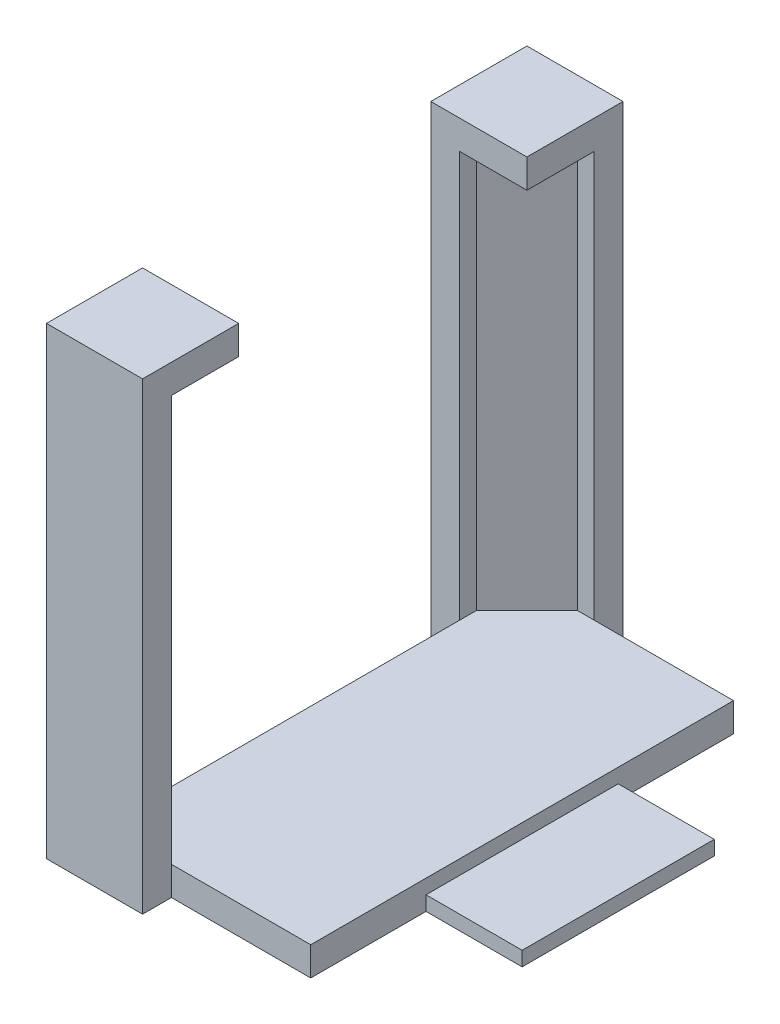
ISO-10303-21;
HEADER;
FILE_DESCRIPTION(('STEP AP214'),'2;1');
FILE_NAME('part.step','',(''),(''),'','','');
FILE_SCHEMA(('AUTOMOTIVE_DESIGN { 1 0 10303 214 1 1 1 1 }'));
ENDSEC;
DATA;
#1=APPLICATION_CONTEXT('core data for automotive mechanical design processes');
#2=APPLICATION_PROTOCOL_DEFINITION('international standard','automotive_design',2000,#1);
#3=PRODUCT_CONTEXT('',#1,'mechanical');
#4=PRODUCT('Part','Part','',(#3));
#5=PRODUCT_RELATED_PRODUCT_CATEGORY('part','',(#4));
#6=PRODUCT_DEFINITION_FORMATION('','',#4);
#7=PRODUCT_DEFINITION_CONTEXT('part definition',#1,'design');
#8=PRODUCT_DEFINITION('design','',#6,#7);
#9=PRODUCT_DEFINITION_SHAPE('','',#8);
#10=(LENGTH_UNIT() NAMED_UNIT(*) SI_UNIT(.MILLI.,.METRE.));
#11=(NAMED_UNIT(*) PLANE_ANGLE_UNIT() SI_UNIT($,.RADIAN.));
#12=(NAMED_UNIT(*) SI_UNIT($,.STERADIAN.) SOLID_ANGLE_UNIT());
#13=UNCERTAINTY_MEASURE_WITH_UNIT(LENGTH_MEASURE(1.E-05),#10,'distance_accuracy_value','');
#14=(GEOMETRIC_REPRESENTATION_CONTEXT(3) GLOBAL_UNCERTAINTY_ASSIGNED_CONTEXT((#13)) GLOBAL_UNIT_ASSIGNED_CONTEXT((#10,
#11,#12)) REPRESENTATION_CONTEXT('',''));
#15=CARTESIAN_POINT('',(0.,0.,0.));
#16=DIRECTION('',(0.,0.,1.));
#17=DIRECTION('',(1.,0.,0.));
#18=AXIS2_PLACEMENT_3D('',#15,#16,#17);
#19=CARTESIAN_POINT('',(-21.5,3.,0.));
#20=DIRECTION('',(-1.,0.,0.));
#21=DIRECTION('',(0.,0.,1.));
#22=AXIS2_PLACEMENT_3D('',#19,#20,#21);
#23=PLANE('',#22);
#24=DIRECTION('',(0.,-1.,0.));
#25=VECTOR('',#24,1.);
#26=CARTESIAN_POINT('',(-21.5,45.25,-37.));
#27=LINE('',#26,#25);
#28=CARTESIAN_POINT('',(-21.5,3.,-37.));
#29=VERTEX_POINT('',#28);
#30=CARTESIAN_POINT('',(-21.5,0.,-37.));
#31=VERTEX_POINT('',#30);
#32=EDGE_CURVE('E278',#29,#31,#27,.T.);
#33=ORIENTED_EDGE('',*,*,#32,.T.);
#34=DIRECTION('',(0.,0.,-1.));
#35=VECTOR('',#34,1.);
#36=CARTESIAN_POINT('',(-21.5,0.,0.));
#37=LINE('',#36,#35);
#38=CARTESIAN_POINT('',(-21.5,0.,-7.));
#39=VERTEX_POINT('',#38);
#40=EDGE_CURVE('E349',#39,#31,#37,.T.);
#41=ORIENTED_EDGE('',*,*,#40,.F.);
#42=DIRECTION('',(0.,-1.,0.));
#43=VECTOR('',#42,1.);
#44=CARTESIAN_POINT('',(-21.5,45.25,-7.));
#45=LINE('',#44,#43);
#46=CARTESIAN_POINT('',(-21.5,3.,-7.));
#47=VERTEX_POINT('',#46);
#48=EDGE_CURVE('E315',#47,#39,#45,.T.);
#49=ORIENTED_EDGE('',*,*,#48,.F.);
#50=DIRECTION('',(0.,0.,-1.));
#51=VECTOR('',#50,1.);
#52=CARTESIAN_POINT('',(-21.5,3.,0.));
#53=LINE('',#52,#51);
#54=EDGE_CURVE('E353',#47,#29,#53,.T.);
#55=ORIENTED_EDGE('',*,*,#54,.T.);
#56=EDGE_LOOP('',(#33,#41,#49,#55));
#57=FACE_BOUND('',#56,.T.);
#58=ADVANCED_FACE('F41',(#57),#23,.T.);
#59=CARTESIAN_POINT('',(0.,3.,0.));
#60=DIRECTION('',(0.,0.,1.));
#61=DIRECTION('',(1.,0.,0.));
#62=AXIS2_PLACEMENT_3D('',#59,#60,#61);
#63=PLANE('',#62);
#64=DIRECTION('',(-1.,0.,0.));
#65=VECTOR('',#64,1.);
#66=CARTESIAN_POINT('',(0.,3.,0.));
#67=LINE('',#66,#65);
#68=CARTESIAN_POINT('',(0.,3.,0.));
#69=VERTEX_POINT('',#68);
#70=CARTESIAN_POINT('',(-14.5,3.,0.));
#71=VERTEX_POINT('',#70);
#72=EDGE_CURVE('E352',#69,#71,#67,.T.);
#73=ORIENTED_EDGE('',*,*,#72,.T.);
#74=DIRECTION('',(0.,-1.,0.));
#75=VECTOR('',#74,1.);
#76=CARTESIAN_POINT('',(-14.5,45.25,0.));
#77=LINE('',#76,#75);
#78=CARTESIAN_POINT('',(-14.5,0.,0.));
#79=VERTEX_POINT('',#78);
#80=EDGE_CURVE('E296',#71,#79,#77,.T.);
#81=ORIENTED_EDGE('',*,*,#80,.T.);
#82=DIRECTION('',(-1.,0.,0.));
#83=VECTOR('',#82,1.);
#84=CARTESIAN_POINT('',(0.,0.,0.));
#85=LINE('',#84,#83);
#86=CARTESIAN_POINT('',(0.,0.,0.));
#87=VERTEX_POINT('',#86);
#88=EDGE_CURVE('E364',#87,#79,#85,.T.);
#89=ORIENTED_EDGE('',*,*,#88,.F.);
#90=DIRECTION('',(0.,-1.,0.));
#91=VECTOR('',#90,1.);
#92=CARTESIAN_POINT('',(0.,3.,0.));
#93=LINE('',#92,#91);
#94=EDGE_CURVE('E375',#69,#87,#93,.T.);
#95=ORIENTED_EDGE('',*,*,#94,.F.);
#96=EDGE_LOOP('',(#73,#81,#89,#95));
#97=FACE_BOUND('',#96,.T.);
#98=ADVANCED_FACE('F467',(#97),#63,.T.);
#99=CARTESIAN_POINT('',(0.,3.,0.));
#100=DIRECTION('',(-1.,0.,0.));
#101=DIRECTION('',(0.,0.,1.));
#102=AXIS2_PLACEMENT_3D('',#99,#100,#101);
#103=PLANE('',#102);
#104=DIRECTION('',(0.,-1.,0.));
#105=VECTOR('',#104,1.);
#106=CARTESIAN_POINT('',(0.,1.5,-12.));
#107=LINE('',#106,#105);
#108=CARTESIAN_POINT('',(0.,1.5,-12.));
#109=VERTEX_POINT('',#108);
#110=CARTESIAN_POINT('',(0.,0.,-12.));
#111=VERTEX_POINT('',#110);
#112=EDGE_CURVE('E341',#109,#111,#107,.T.);
#113=ORIENTED_EDGE('',*,*,#112,.F.);
#114=DIRECTION('',(0.,0.,-1.));
#115=VECTOR('',#114,1.);
#116=CARTESIAN_POINT('',(0.,1.5,0.));
#117=LINE('',#116,#115);
#118=CARTESIAN_POINT('',(0.,1.5,-32.));
#119=VERTEX_POINT('',#118);
#120=EDGE_CURVE('E328',#109,#119,#117,.T.);
#121=ORIENTED_EDGE('',*,*,#120,.T.);
#122=DIRECTION('',(0.,-1.,0.));
#123=VECTOR('',#122,1.);
#124=CARTESIAN_POINT('',(0.,1.5,-32.));
#125=LINE('',#124,#123);
#126=CARTESIAN_POINT('',(0.,0.,-32.));
#127=VERTEX_POINT('',#126);
#128=EDGE_CURVE('E343',#119,#127,#125,.T.);
#129=ORIENTED_EDGE('',*,*,#128,.T.);
#130=DIRECTION('',(0.,0.,-1.));
#131=VECTOR('',#130,1.);
#132=CARTESIAN_POINT('',(0.,0.,0.));
#133=LINE('',#132,#131);
#134=CARTESIAN_POINT('',(0.,0.,-44.));
#135=VERTEX_POINT('',#134);
#136=EDGE_CURVE('E367',#127,#135,#133,.T.);
#137=ORIENTED_EDGE('',*,*,#136,.T.);
#138=DIRECTION('',(0.,-1.,0.));
#139=VECTOR('',#138,1.);
#140=CARTESIAN_POINT('',(0.,3.,-44.));
#141=LINE('',#140,#139);
#142=CARTESIAN_POINT('',(0.,3.,-44.));
#143=VERTEX_POINT('',#142);
#144=EDGE_CURVE('E361',#143,#135,#141,.T.);
#145=ORIENTED_EDGE('',*,*,#144,.F.);
#146=DIRECTION('',(0.,0.,-1.));
#147=VECTOR('',#146,1.);
#148=CARTESIAN_POINT('',(0.,3.,0.));
#149=LINE('',#148,#147);
#150=EDGE_CURVE('E356',#69,#143,#149,.T.);
#151=ORIENTED_EDGE('',*,*,#150,.F.);
#152=ORIENTED_EDGE('',*,*,#94,.T.);
#153=EDGE_CURVE('E368',#87,#111,#133,.T.);
#154=ORIENTED_EDGE('',*,*,#153,.T.);
#155=EDGE_LOOP('',(#113,#121,#129,#137,#145,#151,#152,#154));
#156=FACE_BOUND('',#155,.T.);
#157=ADVANCED_FACE('F472',(#156),#103,.F.);
#158=CARTESIAN_POINT('',(0.,3.,-44.));
#159=DIRECTION('',(0.,0.,1.));
#160=DIRECTION('',(1.,0.,0.));
#161=AXIS2_PLACEMENT_3D('',#158,#159,#160);
#162=PLANE('',#161);
#163=DIRECTION('',(-1.,0.,0.));
#164=VECTOR('',#163,1.);
#165=CARTESIAN_POINT('',(0.,0.,-44.));
#166=LINE('',#165,#164);
#167=CARTESIAN_POINT('',(-14.5,0.,-44.));
#168=VERTEX_POINT('',#167);
#169=EDGE_CURVE('E371',#135,#168,#166,.T.);
#170=ORIENTED_EDGE('',*,*,#169,.T.);
#171=DIRECTION('',(0.,-1.,0.));
#172=VECTOR('',#171,1.);
#173=CARTESIAN_POINT('',(-14.5,45.25,-44.));
#174=LINE('',#173,#172);
#175=CARTESIAN_POINT('',(-14.5,3.,-44.));
#176=VERTEX_POINT('',#175);
#177=EDGE_CURVE('E265',#176,#168,#174,.T.);
#178=ORIENTED_EDGE('',*,*,#177,.F.);
#179=DIRECTION('',(-1.,0.,0.));
#180=VECTOR('',#179,1.);
#181=CARTESIAN_POINT('',(0.,3.,-44.));
#182=LINE('',#181,#180);
#183=EDGE_CURVE('E358',#143,#176,#182,.T.);
#184=ORIENTED_EDGE('',*,*,#183,.F.);
#185=ORIENTED_EDGE('',*,*,#144,.T.);
#186=EDGE_LOOP('',(#170,#178,#184,#185));
#187=FACE_BOUND('',#186,.T.);
#188=ADVANCED_FACE('F546',(#187),#162,.F.);
#189=CARTESIAN_POINT('',(0.,3.,0.));
#190=DIRECTION('',(0.,1.,0.));
#191=DIRECTION('',(0.,0.,1.));
#192=AXIS2_PLACEMENT_3D('',#189,#190,#191);
#193=PLANE('',#192);
#194=DIRECTION('',(1.,0.,0.));
#195=VECTOR('',#194,1.);
#196=CARTESIAN_POINT('',(0.,3.,-44.));
#197=LINE('',#196,#195);
#198=CARTESIAN_POINT('',(-16.25,3.,-44.));
#199=VERTEX_POINT('',#198);
#200=EDGE_CURVE('E286',#199,#176,#197,.T.);
#201=ORIENTED_EDGE('',*,*,#200,.F.);
#202=DIRECTION('',(-0.707106781186552,0.,0.707106781186543));
#203=VECTOR('',#202,1.);
#204=CARTESIAN_POINT('',(-30.1249999999999,3.,-30.1250000000002));
#205=LINE('',#204,#203);
#206=CARTESIAN_POINT('',(-21.5,3.,-38.75));
#207=VERTEX_POINT('',#206);
#208=EDGE_CURVE('E382',#199,#207,#205,.T.);
#209=ORIENTED_EDGE('',*,*,#208,.T.);
#210=DIRECTION('',(0.,0.,1.));
#211=VECTOR('',#210,1.);
#212=CARTESIAN_POINT('',(-21.5,3.,0.));
#213=LINE('',#212,#211);
#214=EDGE_CURVE('E288',#207,#29,#213,.T.);
#215=ORIENTED_EDGE('',*,*,#214,.T.);
#216=ORIENTED_EDGE('',*,*,#54,.F.);
#217=CARTESIAN_POINT('',(-21.5,3.,-5.25000000000004));
#218=VERTEX_POINT('',#217);
#219=EDGE_CURVE('E350',#218,#47,#53,.T.);
#220=ORIENTED_EDGE('',*,*,#219,.F.);
#221=DIRECTION('',(-0.707106781186544,0.,-0.707106781186551));
#222=VECTOR('',#221,1.);
#223=CARTESIAN_POINT('',(-8.1250000000001,3.,8.12500000000001));
#224=LINE('',#223,#222);
#225=CARTESIAN_POINT('',(-16.25,3.,0.));
#226=VERTEX_POINT('',#225);
#227=EDGE_CURVE('E380',#218,#226,#224,.F.);
#228=ORIENTED_EDGE('',*,*,#227,.T.);
#229=DIRECTION('',(1.,0.,0.));
#230=VECTOR('',#229,1.);
#231=CARTESIAN_POINT('',(0.,3.,0.));
#232=LINE('',#231,#230);
#233=EDGE_CURVE('E319',#226,#71,#232,.T.);
#234=ORIENTED_EDGE('',*,*,#233,.T.);
#235=ORIENTED_EDGE('',*,*,#72,.F.);
#236=ORIENTED_EDGE('',*,*,#150,.T.);
#237=ORIENTED_EDGE('',*,*,#183,.T.);
#238=EDGE_LOOP('',(#201,#209,#215,#216,#220,#228,#234,#235,#236,#237));
#239=FACE_BOUND('',#238,.T.);
#240=ADVANCED_FACE('F399',(#239),#193,.T.);
#241=CARTESIAN_POINT('',(0.,0.,0.));
#242=DIRECTION('',(0.,1.,0.));
#243=DIRECTION('',(0.,0.,1.));
#244=AXIS2_PLACEMENT_3D('',#241,#242,#243);
#245=PLANE('',#244);
#246=DIRECTION('',(-1.,0.,0.));
#247=VECTOR('',#246,1.);
#248=CARTESIAN_POINT('',(0.,0.,-7.));
#249=LINE('',#248,#247);
#250=CARTESIAN_POINT('',(-24.5,0.,-7.));
#251=VERTEX_POINT('',#250);
#252=EDGE_CURVE('E290',#39,#251,#249,.T.);
#253=ORIENTED_EDGE('',*,*,#252,.F.);
#254=ORIENTED_EDGE('',*,*,#40,.T.);
#255=DIRECTION('',(-1.,0.,0.));
#256=VECTOR('',#255,1.);
#257=CARTESIAN_POINT('',(0.,0.,-37.));
#258=LINE('',#257,#256);
#259=CARTESIAN_POINT('',(-24.5,0.,-37.));
#260=VERTEX_POINT('',#259);
#261=EDGE_CURVE('E263',#31,#260,#258,.T.);
#262=ORIENTED_EDGE('',*,*,#261,.T.);
#263=DIRECTION('',(0.,0.,-1.));
#264=VECTOR('',#263,1.);
#265=CARTESIAN_POINT('',(-24.5,0.,0.));
#266=LINE('',#265,#264);
#267=CARTESIAN_POINT('',(-24.5,0.,-47.));
#268=VERTEX_POINT('',#267);
#269=EDGE_CURVE('E271',#260,#268,#266,.T.);
#270=ORIENTED_EDGE('',*,*,#269,.T.);
#271=DIRECTION('',(1.,0.,0.));
#272=VECTOR('',#271,1.);
#273=CARTESIAN_POINT('',(0.,0.,-47.));
#274=LINE('',#273,#272);
#275=CARTESIAN_POINT('',(-14.5,0.,-47.));
#276=VERTEX_POINT('',#275);
#277=EDGE_CURVE('E268',#268,#276,#274,.T.);
#278=ORIENTED_EDGE('',*,*,#277,.T.);
#279=DIRECTION('',(0.,0.,1.));
#280=VECTOR('',#279,1.);
#281=CARTESIAN_POINT('',(-14.5,0.,0.));
#282=LINE('',#281,#280);
#283=EDGE_CURVE('E260',#276,#168,#282,.T.);
#284=ORIENTED_EDGE('',*,*,#283,.T.);
#285=ORIENTED_EDGE('',*,*,#169,.F.);
#286=ORIENTED_EDGE('',*,*,#136,.F.);
#287=DIRECTION('',(-1.,0.,0.));
#288=VECTOR('',#287,1.);
#289=CARTESIAN_POINT('',(0.,0.,-32.));
#290=LINE('',#289,#288);
#291=CARTESIAN_POINT('',(10.,0.,-32.));
#292=VERTEX_POINT('',#291);
#293=EDGE_CURVE('E336',#292,#127,#290,.T.);
#294=ORIENTED_EDGE('',*,*,#293,.F.);
#295=DIRECTION('',(0.,0.,-1.));
#296=VECTOR('',#295,1.);
#297=CARTESIAN_POINT('',(10.,0.,0.));
#298=LINE('',#297,#296);
#299=CARTESIAN_POINT('',(10.,0.,-12.));
#300=VERTEX_POINT('',#299);
#301=EDGE_CURVE('E321',#300,#292,#298,.T.);
#302=ORIENTED_EDGE('',*,*,#301,.F.);
#303=DIRECTION('',(1.,0.,0.));
#304=VECTOR('',#303,1.);
#305=CARTESIAN_POINT('',(0.,0.,-12.));
#306=LINE('',#305,#304);
#307=EDGE_CURVE('E326',#111,#300,#306,.T.);
#308=ORIENTED_EDGE('',*,*,#307,.F.);
#309=ORIENTED_EDGE('',*,*,#153,.F.);
#310=ORIENTED_EDGE('',*,*,#88,.T.);
#311=DIRECTION('',(0.,0.,-1.));
#312=VECTOR('',#311,1.);
#313=CARTESIAN_POINT('',(-14.5,0.,0.));
#314=LINE('',#313,#312);
#315=CARTESIAN_POINT('',(-14.5,0.,3.));
#316=VERTEX_POINT('',#315);
#317=EDGE_CURVE('E294',#316,#79,#314,.T.);
#318=ORIENTED_EDGE('',*,*,#317,.F.);
#319=DIRECTION('',(1.,0.,0.));
#320=VECTOR('',#319,1.);
#321=CARTESIAN_POINT('',(0.,0.,2.99999999999999));
#322=LINE('',#321,#320);
#323=CARTESIAN_POINT('',(-24.5,0.,3.00000000000001));
#324=VERTEX_POINT('',#323);
#325=EDGE_CURVE('E300',#324,#316,#322,.T.);
#326=ORIENTED_EDGE('',*,*,#325,.F.);
#327=DIRECTION('',(0.,0.,1.));
#328=VECTOR('',#327,1.);
#329=CARTESIAN_POINT('',(-24.5,0.,0.));
#330=LINE('',#329,#328);
#331=EDGE_CURVE('E298',#251,#324,#330,.T.);
#332=ORIENTED_EDGE('',*,*,#331,.F.);
#333=EDGE_LOOP('',(#253,#254,#262,#270,#278,#284,#285,#286,#294,#302,#308,#309,#310,#318,#326,#332));
#334=FACE_BOUND('',#333,.T.);
#335=ADVANCED_FACE('F424',(#334),#245,.F.);
#336=CARTESIAN_POINT('',(10.,1.5,0.));
#337=DIRECTION('',(-1.,0.,0.));
#338=DIRECTION('',(0.,0.,1.));
#339=AXIS2_PLACEMENT_3D('',#336,#337,#338);
#340=PLANE('',#339);
#341=ORIENTED_EDGE('',*,*,#301,.T.);
#342=DIRECTION('',(0.,-1.,0.));
#343=VECTOR('',#342,1.);
#344=CARTESIAN_POINT('',(10.,1.5,-32.));
#345=LINE('',#344,#343);
#346=CARTESIAN_POINT('',(10.,1.5,-32.));
#347=VERTEX_POINT('',#346);
#348=EDGE_CURVE('E346',#347,#292,#345,.T.);
#349=ORIENTED_EDGE('',*,*,#348,.F.);
#350=DIRECTION('',(0.,0.,-1.));
#351=VECTOR('',#350,1.);
#352=CARTESIAN_POINT('',(10.,1.5,0.));
#353=LINE('',#352,#351);
#354=CARTESIAN_POINT('',(10.,1.5,-12.));
#355=VERTEX_POINT('',#354);
#356=EDGE_CURVE('E322',#355,#347,#353,.T.);
#357=ORIENTED_EDGE('',*,*,#356,.F.);
#358=DIRECTION('',(0.,-1.,0.));
#359=VECTOR('',#358,1.);
#360=CARTESIAN_POINT('',(10.,1.5,-12.));
#361=LINE('',#360,#359);
#362=EDGE_CURVE('E333',#355,#300,#361,.T.);
#363=ORIENTED_EDGE('',*,*,#362,.T.);
#364=EDGE_LOOP('',(#341,#349,#357,#363));
#365=FACE_BOUND('',#364,.T.);
#366=ADVANCED_FACE('F703',(#365),#340,.F.);
#367=CARTESIAN_POINT('',(0.,1.5,-32.));
#368=DIRECTION('',(0.,0.,1.));
#369=DIRECTION('',(1.,0.,0.));
#370=AXIS2_PLACEMENT_3D('',#367,#368,#369);
#371=PLANE('',#370);
#372=ORIENTED_EDGE('',*,*,#293,.T.);
#373=ORIENTED_EDGE('',*,*,#128,.F.);
#374=DIRECTION('',(-1.,0.,0.));
#375=VECTOR('',#374,1.);
#376=CARTESIAN_POINT('',(0.,1.5,-32.));
#377=LINE('',#376,#375);
#378=EDGE_CURVE('E325',#347,#119,#377,.T.);
#379=ORIENTED_EDGE('',*,*,#378,.F.);
#380=ORIENTED_EDGE('',*,*,#348,.T.);
#381=EDGE_LOOP('',(#372,#373,#379,#380));
#382=FACE_BOUND('',#381,.T.);
#383=ADVANCED_FACE('F693',(#382),#371,.F.);
#384=CARTESIAN_POINT('',(0.,1.5,-12.));
#385=DIRECTION('',(0.,0.,-1.));
#386=DIRECTION('',(-1.,0.,0.));
#387=AXIS2_PLACEMENT_3D('',#384,#385,#386);
#388=PLANE('',#387);
#389=ORIENTED_EDGE('',*,*,#307,.T.);
#390=ORIENTED_EDGE('',*,*,#362,.F.);
#391=DIRECTION('',(1.,0.,0.));
#392=VECTOR('',#391,1.);
#393=CARTESIAN_POINT('',(0.,1.5,-12.));
#394=LINE('',#393,#392);
#395=EDGE_CURVE('E331',#109,#355,#394,.T.);
#396=ORIENTED_EDGE('',*,*,#395,.F.);
#397=ORIENTED_EDGE('',*,*,#112,.T.);
#398=EDGE_LOOP('',(#389,#390,#396,#397));
#399=FACE_BOUND('',#398,.T.);
#400=ADVANCED_FACE('F684',(#399),#388,.F.);
#401=CARTESIAN_POINT('',(0.,1.5,0.));
#402=DIRECTION('',(0.,1.,0.));
#403=DIRECTION('',(0.,0.,1.));
#404=AXIS2_PLACEMENT_3D('',#401,#402,#403);
#405=PLANE('',#404);
#406=ORIENTED_EDGE('',*,*,#356,.T.);
#407=ORIENTED_EDGE('',*,*,#378,.T.);
#408=ORIENTED_EDGE('',*,*,#120,.F.);
#409=ORIENTED_EDGE('',*,*,#395,.T.);
#410=EDGE_LOOP('',(#406,#407,#408,#409));
#411=FACE_BOUND('',#410,.T.);
#412=ADVANCED_FACE('F558',(#411),#405,.T.);
#413=CARTESIAN_POINT('',(-21.5,45.25,0.));
#414=DIRECTION('',(-1.,0.,0.));
#415=DIRECTION('',(0.,0.,1.));
#416=AXIS2_PLACEMENT_3D('',#413,#414,#415);
#417=PLANE('',#416);
#418=DIRECTION('',(0.,0.,-1.));
#419=VECTOR('',#418,1.);
#420=CARTESIAN_POINT('',(-21.5,45.25,0.));
#421=LINE('',#420,#419);
#422=CARTESIAN_POINT('',(-21.5,45.25,-5.25000000000004));
#423=VERTEX_POINT('',#422);
#424=CARTESIAN_POINT('',(-21.5,45.25,-7.));
#425=VERTEX_POINT('',#424);
#426=EDGE_CURVE('E291',#423,#425,#421,.T.);
#427=ORIENTED_EDGE('',*,*,#426,.F.);
#428=DIRECTION('',(0.,-1.,0.));
#429=VECTOR('',#428,1.);
#430=CARTESIAN_POINT('',(-21.5,3.,-5.25000000000004));
#431=LINE('',#430,#429);
#432=EDGE_CURVE('E388',#423,#218,#431,.T.);
#433=ORIENTED_EDGE('',*,*,#432,.T.);
#434=ORIENTED_EDGE('',*,*,#219,.T.);
#435=EDGE_CURVE('E316',#425,#47,#45,.T.);
#436=ORIENTED_EDGE('',*,*,#435,.F.);
#437=EDGE_LOOP('',(#427,#433,#434,#436));
#438=FACE_BOUND('',#437,.T.);
#439=ADVANCED_FACE('F393',(#438),#417,.F.);
#440=CARTESIAN_POINT('',(0.,45.25,-7.));
#441=DIRECTION('',(0.,0.,1.));
#442=DIRECTION('',(1.,0.,0.));
#443=AXIS2_PLACEMENT_3D('',#440,#441,#442);
#444=PLANE('',#443);
#445=ORIENTED_EDGE('',*,*,#252,.T.);
#446=DIRECTION('',(0.,-1.,0.));
#447=VECTOR('',#446,1.);
#448=CARTESIAN_POINT('',(-24.5,45.25,-7.));
#449=LINE('',#448,#447);
#450=CARTESIAN_POINT('',(-24.5,48.25,-7.));
#451=VERTEX_POINT('',#450);
#452=EDGE_CURVE('E312',#451,#251,#449,.T.);
#453=ORIENTED_EDGE('',*,*,#452,.F.);
#454=DIRECTION('',(-1.,0.,0.));
#455=VECTOR('',#454,1.);
#456=CARTESIAN_POINT('',(-24.5,48.25,-7.));
#457=LINE('',#456,#455);
#458=CARTESIAN_POINT('',(-14.5,48.25,-7.));
#459=VERTEX_POINT('',#458);
#460=EDGE_CURVE('E251',#459,#451,#457,.T.);
#461=ORIENTED_EDGE('',*,*,#460,.F.);
#462=DIRECTION('',(0.,-1.,0.));
#463=VECTOR('',#462,1.);
#464=CARTESIAN_POINT('',(-14.5,48.25,-7.));
#465=LINE('',#464,#463);
#466=CARTESIAN_POINT('',(-14.5,45.25,-7.));
#467=VERTEX_POINT('',#466);
#468=EDGE_CURVE('E254',#459,#467,#465,.T.);
#469=ORIENTED_EDGE('',*,*,#468,.T.);
#470=DIRECTION('',(-1.,0.,0.));
#471=VECTOR('',#470,1.);
#472=CARTESIAN_POINT('',(-24.5,45.25,-7.));
#473=LINE('',#472,#471);
#474=EDGE_CURVE('E246',#467,#425,#473,.T.);
#475=ORIENTED_EDGE('',*,*,#474,.T.);
#476=ORIENTED_EDGE('',*,*,#435,.T.);
#477=ORIENTED_EDGE('',*,*,#48,.T.);
#478=EDGE_LOOP('',(#445,#453,#461,#469,#475,#476,#477));
#479=FACE_BOUND('',#478,.T.);
#480=ADVANCED_FACE('F439',(#479),#444,.F.);
#481=CARTESIAN_POINT('',(-24.5,45.25,0.));
#482=DIRECTION('',(1.,0.,0.));
#483=DIRECTION('',(0.,0.,-1.));
#484=AXIS2_PLACEMENT_3D('',#481,#482,#483);
#485=PLANE('',#484);
#486=ORIENTED_EDGE('',*,*,#331,.T.);
#487=DIRECTION('',(0.,-1.,0.));
#488=VECTOR('',#487,1.);
#489=CARTESIAN_POINT('',(-24.5,45.25,3.00000000000001));
#490=LINE('',#489,#488);
#491=CARTESIAN_POINT('',(-24.5,48.25,3.00000000000001));
#492=VERTEX_POINT('',#491);
#493=EDGE_CURVE('E309',#492,#324,#490,.T.);
#494=ORIENTED_EDGE('',*,*,#493,.F.);
#495=DIRECTION('',(0.,0.,1.));
#496=VECTOR('',#495,1.);
#497=CARTESIAN_POINT('',(-24.5,48.25,3.00000000000001));
#498=LINE('',#497,#496);
#499=EDGE_CURVE('E242',#451,#492,#498,.T.);
#500=ORIENTED_EDGE('',*,*,#499,.F.);
#501=ORIENTED_EDGE('',*,*,#452,.T.);
#502=EDGE_LOOP('',(#486,#494,#500,#501));
#503=FACE_BOUND('',#502,.T.);
#504=ADVANCED_FACE('F443',(#503),#485,.F.);
#505=CARTESIAN_POINT('',(0.,45.25,2.99999999999999));
#506=DIRECTION('',(0.,0.,-1.));
#507=DIRECTION('',(-1.,0.,0.));
#508=AXIS2_PLACEMENT_3D('',#505,#506,#507);
#509=PLANE('',#508);
#510=ORIENTED_EDGE('',*,*,#325,.T.);
#511=DIRECTION('',(0.,-1.,0.));
#512=VECTOR('',#511,1.);
#513=CARTESIAN_POINT('',(-14.5,45.25,3.));
#514=LINE('',#513,#512);
#515=CARTESIAN_POINT('',(-14.5,48.25,3.));
#516=VERTEX_POINT('',#515);
#517=EDGE_CURVE('E306',#516,#316,#514,.T.);
#518=ORIENTED_EDGE('',*,*,#517,.F.);
#519=DIRECTION('',(1.,0.,0.));
#520=VECTOR('',#519,1.);
#521=CARTESIAN_POINT('',(-24.5,48.25,3.00000000000001));
#522=LINE('',#521,#520);
#523=EDGE_CURVE('E245',#492,#516,#522,.T.);
#524=ORIENTED_EDGE('',*,*,#523,.F.);
#525=ORIENTED_EDGE('',*,*,#493,.T.);
#526=EDGE_LOOP('',(#510,#518,#524,#525));
#527=FACE_BOUND('',#526,.T.);
#528=ADVANCED_FACE('F464',(#527),#509,.F.);
#529=CARTESIAN_POINT('',(-14.5,45.25,0.));
#530=DIRECTION('',(-1.,0.,0.));
#531=DIRECTION('',(0.,0.,1.));
#532=AXIS2_PLACEMENT_3D('',#529,#530,#531);
#533=PLANE('',#532);
#534=ORIENTED_EDGE('',*,*,#317,.T.);
#535=ORIENTED_EDGE('',*,*,#80,.F.);
#536=CARTESIAN_POINT('',(-14.5,45.25,0.));
#537=VERTEX_POINT('',#536);
#538=EDGE_CURVE('E303',#537,#71,#77,.T.);
#539=ORIENTED_EDGE('',*,*,#538,.F.);
#540=DIRECTION('',(0.,0.,-1.));
#541=VECTOR('',#540,1.);
#542=CARTESIAN_POINT('',(-14.5,45.25,3.));
#543=LINE('',#542,#541);
#544=EDGE_CURVE('E216',#537,#467,#543,.T.);
#545=ORIENTED_EDGE('',*,*,#544,.T.);
#546=ORIENTED_EDGE('',*,*,#468,.F.);
#547=DIRECTION('',(0.,0.,-1.));
#548=VECTOR('',#547,1.);
#549=CARTESIAN_POINT('',(-14.5,48.25,3.));
#550=LINE('',#549,#548);
#551=EDGE_CURVE('E249',#516,#459,#550,.T.);
#552=ORIENTED_EDGE('',*,*,#551,.F.);
#553=ORIENTED_EDGE('',*,*,#517,.T.);
#554=EDGE_LOOP('',(#534,#535,#539,#545,#546,#552,#553));
#555=FACE_BOUND('',#554,.T.);
#556=ADVANCED_FACE('F453',(#555),#533,.F.);
#557=CARTESIAN_POINT('',(0.,45.25,0.));
#558=DIRECTION('',(0.,0.,1.));
#559=DIRECTION('',(1.,0.,0.));
#560=AXIS2_PLACEMENT_3D('',#557,#558,#559);
#561=PLANE('',#560);
#562=ORIENTED_EDGE('',*,*,#233,.F.);
#563=DIRECTION('',(0.,1.,0.));
#564=VECTOR('',#563,1.);
#565=CARTESIAN_POINT('',(-16.25,45.25,0.));
#566=LINE('',#565,#564);
#567=CARTESIAN_POINT('',(-16.25,45.25,0.));
#568=VERTEX_POINT('',#567);
#569=EDGE_CURVE('E50',#226,#568,#566,.T.);
#570=ORIENTED_EDGE('',*,*,#569,.T.);
#571=DIRECTION('',(-1.,0.,0.));
#572=VECTOR('',#571,1.);
#573=CARTESIAN_POINT('',(0.,45.25,0.));
#574=LINE('',#573,#572);
#575=EDGE_CURVE('E293',#537,#568,#574,.T.);
#576=ORIENTED_EDGE('',*,*,#575,.F.);
#577=ORIENTED_EDGE('',*,*,#538,.T.);
#578=EDGE_LOOP('',(#562,#570,#576,#577));
#579=FACE_BOUND('',#578,.T.);
#580=ADVANCED_FACE('F456',(#579),#561,.F.);
#581=CARTESIAN_POINT('',(-14.5,45.25,0.));
#582=DIRECTION('',(1.,0.,0.));
#583=DIRECTION('',(0.,0.,-1.));
#584=AXIS2_PLACEMENT_3D('',#581,#582,#583);
#585=PLANE('',#584);
#586=ORIENTED_EDGE('',*,*,#283,.F.);
#587=DIRECTION('',(0.,-1.,0.));
#588=VECTOR('',#587,1.);
#589=CARTESIAN_POINT('',(-14.5,45.25,-47.));
#590=LINE('',#589,#588);
#591=CARTESIAN_POINT('',(-14.5,48.25,-47.));
#592=VERTEX_POINT('',#591);
#593=EDGE_CURVE('E284',#592,#276,#590,.T.);
#594=ORIENTED_EDGE('',*,*,#593,.F.);
#595=DIRECTION('',(0.,0.,-1.));
#596=VECTOR('',#595,1.);
#597=CARTESIAN_POINT('',(-14.5,48.25,-47.));
#598=LINE('',#597,#596);
#599=CARTESIAN_POINT('',(-14.5,48.25,-37.));
#600=VERTEX_POINT('',#599);
#601=EDGE_CURVE('E226',#600,#592,#598,.T.);
#602=ORIENTED_EDGE('',*,*,#601,.F.);
#603=DIRECTION('',(0.,-1.,0.));
#604=VECTOR('',#603,1.);
#605=CARTESIAN_POINT('',(-14.5,48.25,-37.));
#606=LINE('',#605,#604);
#607=CARTESIAN_POINT('',(-14.5,45.25,-37.));
#608=VERTEX_POINT('',#607);
#609=EDGE_CURVE('E207',#600,#608,#606,.T.);
#610=ORIENTED_EDGE('',*,*,#609,.T.);
#611=DIRECTION('',(0.,0.,-1.));
#612=VECTOR('',#611,1.);
#613=CARTESIAN_POINT('',(-14.5,45.25,-47.));
#614=LINE('',#613,#612);
#615=CARTESIAN_POINT('',(-14.5,45.25,-44.));
#616=VERTEX_POINT('',#615);
#617=EDGE_CURVE('E217',#608,#616,#614,.T.);
#618=ORIENTED_EDGE('',*,*,#617,.T.);
#619=EDGE_CURVE('E276',#616,#176,#174,.T.);
#620=ORIENTED_EDGE('',*,*,#619,.T.);
#621=ORIENTED_EDGE('',*,*,#177,.T.);
#622=EDGE_LOOP('',(#586,#594,#602,#610,#618,#620,#621));
#623=FACE_BOUND('',#622,.T.);
#624=ADVANCED_FACE('F222',(#623),#585,.T.);
#625=CARTESIAN_POINT('',(0.,45.25,-47.));
#626=DIRECTION('',(0.,0.,-1.));
#627=DIRECTION('',(-1.,0.,0.));
#628=AXIS2_PLACEMENT_3D('',#625,#626,#627);
#629=PLANE('',#628);
#630=ORIENTED_EDGE('',*,*,#277,.F.);
#631=DIRECTION('',(0.,-1.,0.));
#632=VECTOR('',#631,1.);
#633=CARTESIAN_POINT('',(-24.5,45.25,-47.));
#634=LINE('',#633,#632);
#635=CARTESIAN_POINT('',(-24.5,48.25,-47.));
#636=VERTEX_POINT('',#635);
#637=EDGE_CURVE('E282',#636,#268,#634,.T.);
#638=ORIENTED_EDGE('',*,*,#637,.F.);
#639=DIRECTION('',(-1.,0.,0.));
#640=VECTOR('',#639,1.);
#641=CARTESIAN_POINT('',(-24.5,48.25,-47.));
#642=LINE('',#641,#640);
#643=EDGE_CURVE('E231',#592,#636,#642,.T.);
#644=ORIENTED_EDGE('',*,*,#643,.F.);
#645=ORIENTED_EDGE('',*,*,#593,.T.);
#646=EDGE_LOOP('',(#630,#638,#644,#645));
#647=FACE_BOUND('',#646,.T.);
#648=ADVANCED_FACE('F429',(#647),#629,.T.);
#649=CARTESIAN_POINT('',(-24.5,45.25,0.));
#650=DIRECTION('',(-1.,0.,0.));
#651=DIRECTION('',(0.,0.,1.));
#652=AXIS2_PLACEMENT_3D('',#649,#650,#651);
#653=PLANE('',#652);
#654=ORIENTED_EDGE('',*,*,#269,.F.);
#655=DIRECTION('',(0.,-1.,0.));
#656=VECTOR('',#655,1.);
#657=CARTESIAN_POINT('',(-24.5,45.25,-37.));
#658=LINE('',#657,#656);
#659=CARTESIAN_POINT('',(-24.5,48.25,-37.));
#660=VERTEX_POINT('',#659);
#661=EDGE_CURVE('E280',#660,#260,#658,.T.);
#662=ORIENTED_EDGE('',*,*,#661,.F.);
#663=DIRECTION('',(0.,0.,1.));
#664=VECTOR('',#663,1.);
#665=CARTESIAN_POINT('',(-24.5,48.25,-47.));
#666=LINE('',#665,#664);
#667=EDGE_CURVE('E234',#636,#660,#666,.T.);
#668=ORIENTED_EDGE('',*,*,#667,.F.);
#669=ORIENTED_EDGE('',*,*,#637,.T.);
#670=EDGE_LOOP('',(#654,#662,#668,#669));
#671=FACE_BOUND('',#670,.T.);
#672=ADVANCED_FACE('F435',(#671),#653,.T.);
#673=CARTESIAN_POINT('',(0.,45.25,-37.));
#674=DIRECTION('',(0.,0.,1.));
#675=DIRECTION('',(1.,0.,0.));
#676=AXIS2_PLACEMENT_3D('',#673,#674,#675);
#677=PLANE('',#676);
#678=ORIENTED_EDGE('',*,*,#261,.F.);
#679=ORIENTED_EDGE('',*,*,#32,.F.);
#680=CARTESIAN_POINT('',(-21.5,45.25,-37.));
#681=VERTEX_POINT('',#680);
#682=EDGE_CURVE('E211',#681,#29,#27,.T.);
#683=ORIENTED_EDGE('',*,*,#682,.F.);
#684=DIRECTION('',(1.,0.,0.));
#685=VECTOR('',#684,1.);
#686=CARTESIAN_POINT('',(-24.5,45.25,-37.));
#687=LINE('',#686,#685);
#688=EDGE_CURVE('E202',#681,#608,#687,.T.);
#689=ORIENTED_EDGE('',*,*,#688,.T.);
#690=ORIENTED_EDGE('',*,*,#609,.F.);
#691=DIRECTION('',(1.,0.,0.));
#692=VECTOR('',#691,1.);
#693=CARTESIAN_POINT('',(-24.5,48.25,-37.));
#694=LINE('',#693,#692);
#695=EDGE_CURVE('E238',#660,#600,#694,.T.);
#696=ORIENTED_EDGE('',*,*,#695,.F.);
#697=ORIENTED_EDGE('',*,*,#661,.T.);
#698=EDGE_LOOP('',(#678,#679,#683,#689,#690,#696,#697));
#699=FACE_BOUND('',#698,.T.);
#700=ADVANCED_FACE('F205',(#699),#677,.T.);
#701=CARTESIAN_POINT('',(-21.5,45.25,0.));
#702=DIRECTION('',(-1.,0.,0.));
#703=DIRECTION('',(0.,0.,1.));
#704=AXIS2_PLACEMENT_3D('',#701,#702,#703);
#705=PLANE('',#704);
#706=ORIENTED_EDGE('',*,*,#214,.F.);
#707=DIRECTION('',(0.,1.,0.));
#708=VECTOR('',#707,1.);
#709=CARTESIAN_POINT('',(-21.5,45.25,-38.75));
#710=LINE('',#709,#708);
#711=CARTESIAN_POINT('',(-21.5,45.25,-38.75));
#712=VERTEX_POINT('',#711);
#713=EDGE_CURVE('E384',#207,#712,#710,.T.);
#714=ORIENTED_EDGE('',*,*,#713,.T.);
#715=DIRECTION('',(0.,0.,-1.));
#716=VECTOR('',#715,1.);
#717=CARTESIAN_POINT('',(-21.5,45.25,0.));
#718=LINE('',#717,#716);
#719=EDGE_CURVE('E261',#681,#712,#718,.T.);
#720=ORIENTED_EDGE('',*,*,#719,.F.);
#721=ORIENTED_EDGE('',*,*,#682,.T.);
#722=EDGE_LOOP('',(#706,#714,#720,#721));
#723=FACE_BOUND('',#722,.T.);
#724=ADVANCED_FACE('F406',(#723),#705,.F.);
#725=CARTESIAN_POINT('',(0.,45.25,-44.));
#726=DIRECTION('',(0.,0.,1.));
#727=DIRECTION('',(1.,0.,0.));
#728=AXIS2_PLACEMENT_3D('',#725,#726,#727);
#729=PLANE('',#728);
#730=DIRECTION('',(-1.,0.,0.));
#731=VECTOR('',#730,1.);
#732=CARTESIAN_POINT('',(0.,45.25,-44.));
#733=LINE('',#732,#731);
#734=CARTESIAN_POINT('',(-16.25,45.25,-44.));
#735=VERTEX_POINT('',#734);
#736=EDGE_CURVE('E230',#616,#735,#733,.T.);
#737=ORIENTED_EDGE('',*,*,#736,.T.);
#738=DIRECTION('',(0.,-1.,0.));
#739=VECTOR('',#738,1.);
#740=CARTESIAN_POINT('',(-16.25,45.25,-44.));
#741=LINE('',#740,#739);
#742=EDGE_CURVE('E377',#735,#199,#741,.T.);
#743=ORIENTED_EDGE('',*,*,#742,.T.);
#744=ORIENTED_EDGE('',*,*,#200,.T.);
#745=ORIENTED_EDGE('',*,*,#619,.F.);
#746=EDGE_LOOP('',(#737,#743,#744,#745));
#747=FACE_BOUND('',#746,.T.);
#748=ADVANCED_FACE('F413',(#747),#729,.T.);
#749=CARTESIAN_POINT('',(0.,48.25,0.));
#750=DIRECTION('',(0.,-1.,0.));
#751=DIRECTION('',(0.,0.,-1.));
#752=AXIS2_PLACEMENT_3D('',#749,#750,#751);
#753=PLANE('',#752);
#754=ORIENTED_EDGE('',*,*,#499,.T.);
#755=ORIENTED_EDGE('',*,*,#523,.T.);
#756=ORIENTED_EDGE('',*,*,#551,.T.);
#757=ORIENTED_EDGE('',*,*,#460,.T.);
#758=EDGE_LOOP('',(#754,#755,#756,#757));
#759=FACE_BOUND('',#758,.T.);
#760=ADVANCED_FACE('F446',(#759),#753,.F.);
#761=CARTESIAN_POINT('',(0.,45.25,0.));
#762=DIRECTION('',(0.,-1.,0.));
#763=DIRECTION('',(0.,0.,-1.));
#764=AXIS2_PLACEMENT_3D('',#761,#762,#763);
#765=PLANE('',#764);
#766=ORIENTED_EDGE('',*,*,#575,.T.);
#767=DIRECTION('',(0.707106781186544,0.,0.707106781186551));
#768=VECTOR('',#767,1.);
#769=CARTESIAN_POINT('',(-8.1250000000001,45.25,8.12500000000001));
#770=LINE('',#769,#768);
#771=EDGE_CURVE('E11',#568,#423,#770,.F.);
#772=ORIENTED_EDGE('',*,*,#771,.T.);
#773=ORIENTED_EDGE('',*,*,#426,.T.);
#774=ORIENTED_EDGE('',*,*,#474,.F.);
#775=ORIENTED_EDGE('',*,*,#544,.F.);
#776=EDGE_LOOP('',(#766,#772,#773,#774,#775));
#777=FACE_BOUND('',#776,.T.);
#778=ADVANCED_FACE('F452',(#777),#765,.T.);
#779=CARTESIAN_POINT('',(0.,48.25,0.));
#780=DIRECTION('',(0.,-1.,0.));
#781=DIRECTION('',(0.,0.,-1.));
#782=AXIS2_PLACEMENT_3D('',#779,#780,#781);
#783=PLANE('',#782);
#784=ORIENTED_EDGE('',*,*,#643,.T.);
#785=ORIENTED_EDGE('',*,*,#667,.T.);
#786=ORIENTED_EDGE('',*,*,#695,.T.);
#787=ORIENTED_EDGE('',*,*,#601,.T.);
#788=EDGE_LOOP('',(#784,#785,#786,#787));
#789=FACE_BOUND('',#788,.T.);
#790=ADVANCED_FACE('F433',(#789),#783,.F.);
#791=CARTESIAN_POINT('',(0.,45.25,0.));
#792=DIRECTION('',(0.,-1.,0.));
#793=DIRECTION('',(0.,0.,-1.));
#794=AXIS2_PLACEMENT_3D('',#791,#792,#793);
#795=PLANE('',#794);
#796=ORIENTED_EDGE('',*,*,#719,.T.);
#797=DIRECTION('',(0.707106781186552,0.,-0.707106781186543));
#798=VECTOR('',#797,1.);
#799=CARTESIAN_POINT('',(-30.1249999999999,45.25,-30.1250000000002));
#800=LINE('',#799,#798);
#801=EDGE_CURVE('E386',#712,#735,#800,.T.);
#802=ORIENTED_EDGE('',*,*,#801,.T.);
#803=ORIENTED_EDGE('',*,*,#736,.F.);
#804=ORIENTED_EDGE('',*,*,#617,.F.);
#805=ORIENTED_EDGE('',*,*,#688,.F.);
#806=EDGE_LOOP('',(#796,#802,#803,#804,#805));
#807=FACE_BOUND('',#806,.T.);
#808=ADVANCED_FACE('F228',(#807),#795,.T.);
#809=CARTESIAN_POINT('',(-16.25,45.25,-44.));
#810=DIRECTION('',(-0.707106781186543,0.,-0.707106781186552));
#811=DIRECTION('',(0.,-1.,0.));
#812=AXIS2_PLACEMENT_3D('',#809,#810,#811);
#813=PLANE('',#812);
#814=ORIENTED_EDGE('',*,*,#801,.F.);
#815=ORIENTED_EDGE('',*,*,#713,.F.);
#816=ORIENTED_EDGE('',*,*,#208,.F.);
#817=ORIENTED_EDGE('',*,*,#742,.F.);
#818=EDGE_LOOP('',(#814,#815,#816,#817));
#819=FACE_BOUND('',#818,.T.);
#820=ADVANCED_FACE('F411',(#819),#813,.F.);
#821=CARTESIAN_POINT('',(-21.5,45.25,-5.25000000000004));
#822=DIRECTION('',(0.707106781186551,0.,-0.707106781186544));
#823=DIRECTION('',(0.,1.,0.));
#824=AXIS2_PLACEMENT_3D('',#821,#822,#823);
#825=PLANE('',#824);
#826=ORIENTED_EDGE('',*,*,#771,.F.);
#827=ORIENTED_EDGE('',*,*,#569,.F.);
#828=ORIENTED_EDGE('',*,*,#227,.F.);
#829=ORIENTED_EDGE('',*,*,#432,.F.);
#830=EDGE_LOOP('',(#826,#827,#828,#829));
#831=FACE_BOUND('',#830,.T.);
#832=ADVANCED_FACE('F44',(#831),#825,.T.);
#833=CLOSED_SHELL('',(#58,#98,#157,#188,#240,#335,#366,#383,#400,#412,#439,#480,#504,#528,#556,
#580,#624,#648,#672,#700,#724,#748,#760,#778,#790,#808,#820,#832));
#834=MANIFOLD_SOLID_BREP('B2',#833);
#835=ADVANCED_BREP_SHAPE_REPRESENTATION('',(#18,#834),#14);
#836=SHAPE_DEFINITION_REPRESENTATION(#9,#835);
ENDSEC;
END-ISO-10303-21;
